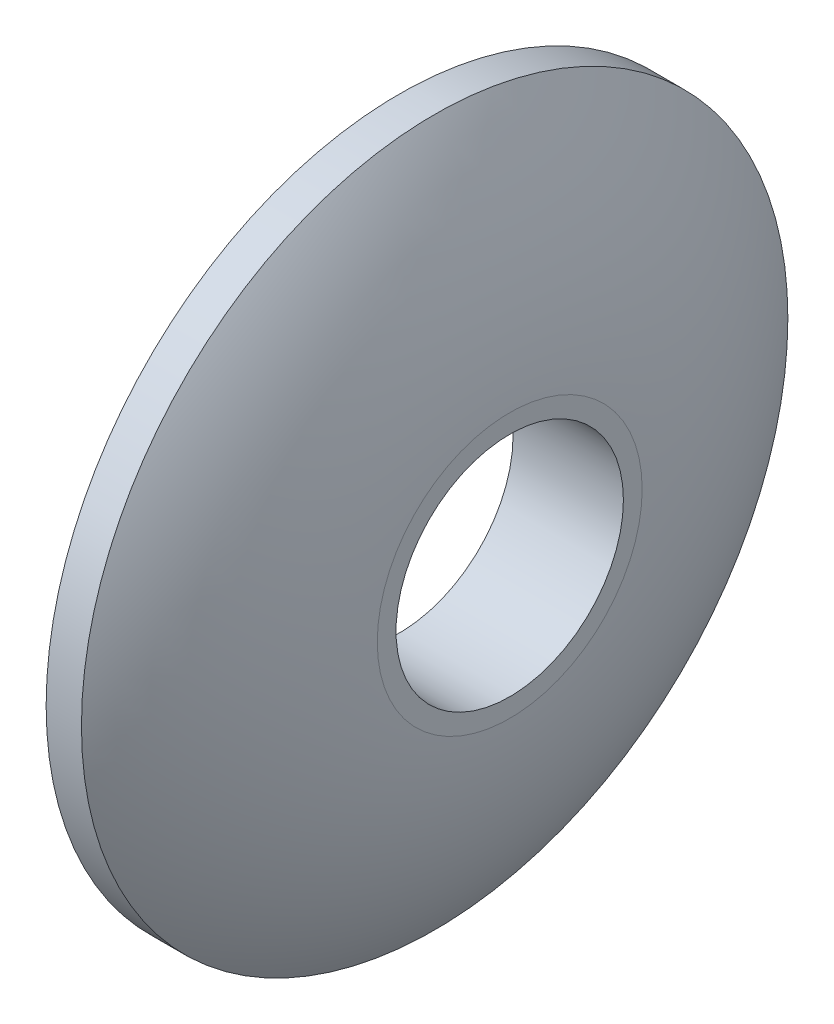
ISO-10303-21;
HEADER;
FILE_DESCRIPTION(('STEP AP214'),'2;1');
FILE_NAME('part.step','',(''),(''),'','','');
FILE_SCHEMA(('AUTOMOTIVE_DESIGN { 1 0 10303 214 1 1 1 1 }'));
ENDSEC;
DATA;
#1=APPLICATION_CONTEXT('core data for automotive mechanical design processes');
#2=APPLICATION_PROTOCOL_DEFINITION('international standard','automotive_design',2000,#1);
#3=PRODUCT_CONTEXT('',#1,'mechanical');
#4=PRODUCT('Part','Part','',(#3));
#5=PRODUCT_RELATED_PRODUCT_CATEGORY('part','',(#4));
#6=PRODUCT_DEFINITION_FORMATION('','',#4);
#7=PRODUCT_DEFINITION_CONTEXT('part definition',#1,'design');
#8=PRODUCT_DEFINITION('design','',#6,#7);
#9=PRODUCT_DEFINITION_SHAPE('','',#8);
#10=(LENGTH_UNIT() NAMED_UNIT(*) SI_UNIT(.MILLI.,.METRE.));
#11=(NAMED_UNIT(*) PLANE_ANGLE_UNIT() SI_UNIT($,.RADIAN.));
#12=(NAMED_UNIT(*) SI_UNIT($,.STERADIAN.) SOLID_ANGLE_UNIT());
#13=UNCERTAINTY_MEASURE_WITH_UNIT(LENGTH_MEASURE(1.E-05),#10,'distance_accuracy_value','');
#14=(GEOMETRIC_REPRESENTATION_CONTEXT(3) GLOBAL_UNCERTAINTY_ASSIGNED_CONTEXT((#13)) GLOBAL_UNIT_ASSIGNED_CONTEXT((#10,
#11,#12)) REPRESENTATION_CONTEXT('',''));
#15=CARTESIAN_POINT('',(0.,0.,0.));
#16=DIRECTION('',(0.,0.,1.));
#17=DIRECTION('',(1.,0.,0.));
#18=AXIS2_PLACEMENT_3D('',#15,#16,#17);
#19=CARTESIAN_POINT('',(0.,0.,0.));
#20=DIRECTION('',(1.,0.,0.));
#21=DIRECTION('',(0.,0.,-1.));
#22=AXIS2_PLACEMENT_3D('',#19,#20,#21);
#23=PLANE('',#22);
#24=CARTESIAN_POINT('',(0.,0.,0.));
#25=DIRECTION('',(1.,0.,0.));
#26=DIRECTION('',(0.,0.,-1.));
#27=AXIS2_PLACEMENT_3D('',#24,#25,#26);
#28=CIRCLE('',#27,2.575);
#29=CARTESIAN_POINT('',(0.,0.,-2.575));
#30=VERTEX_POINT('',#29);
#31=EDGE_CURVE('E54',#30,#30,#28,.T.);
#32=ORIENTED_EDGE('',*,*,#31,.T.);
#33=EDGE_LOOP('',(#32));
#34=FACE_BOUND('',#33,.T.);
#35=CARTESIAN_POINT('',(0.,0.,0.));
#36=DIRECTION('',(-1.,0.,0.));
#37=DIRECTION('',(0.,0.,1.));
#38=AXIS2_PLACEMENT_3D('',#35,#36,#37);
#39=CIRCLE('',#38,8.);
#40=CARTESIAN_POINT('',(0.,0.,8.));
#41=VERTEX_POINT('',#40);
#42=EDGE_CURVE('E10',#41,#41,#39,.T.);
#43=ORIENTED_EDGE('',*,*,#42,.T.);
#44=EDGE_LOOP('',(#43));
#45=FACE_BOUND('',#44,.T.);
#46=ADVANCED_FACE('F37',(#34,#45),#23,.F.);
#47=CARTESIAN_POINT('',(-13.2765957446808,0.,0.));
#48=DIRECTION('',(-1.,0.,0.));
#49=DIRECTION('',(0.,0.,1.));
#50=AXIS2_PLACEMENT_3D('',#47,#48,#49);
#51=CYLINDRICAL_SURFACE('',#50,8.);
#52=ORIENTED_EDGE('',*,*,#42,.F.);
#53=EDGE_LOOP('',(#52));
#54=FACE_BOUND('',#53,.T.);
#55=CARTESIAN_POINT('',(0.799999999999999,0.,0.));
#56=DIRECTION('',(-1.,0.,0.));
#57=DIRECTION('',(0.,0.,1.));
#58=AXIS2_PLACEMENT_3D('',#55,#56,#57);
#59=CIRCLE('',#58,8.);
#60=CARTESIAN_POINT('',(0.799999999999999,0.,8.));
#61=VERTEX_POINT('',#60);
#62=EDGE_CURVE('E44',#61,#61,#59,.T.);
#63=ORIENTED_EDGE('',*,*,#62,.T.);
#64=EDGE_LOOP('',(#63));
#65=FACE_BOUND('',#64,.T.);
#66=ADVANCED_FACE('F80',(#54,#65),#51,.T.);
#67=CARTESIAN_POINT('',(-7.48169551799365,0.,0.));
#68=DIRECTION('',(-1.,0.,0.));
#69=DIRECTION('',(0.,0.,1.));
#70=AXIS2_PLACEMENT_3D('',#67,#68,#69);
#71=DEGENERATE_TOROIDAL_SURFACE('',#70,2.39522352388216,10.,.T.);
#72=ORIENTED_EDGE('',*,*,#62,.F.);
#73=EDGE_LOOP('',(#72));
#74=FACE_BOUND('',#73,.T.);
#75=CARTESIAN_POINT('',(2.5,0.,0.));
#76=DIRECTION('',(-1.,0.,0.));
#77=DIRECTION('',(0.,0.,1.));
#78=AXIS2_PLACEMENT_3D('',#75,#76,#77);
#79=CIRCLE('',#78,3.);
#80=CARTESIAN_POINT('',(2.5,0.,3.));
#81=VERTEX_POINT('',#80);
#82=EDGE_CURVE('E49',#81,#81,#79,.T.);
#83=ORIENTED_EDGE('',*,*,#82,.T.);
#84=EDGE_LOOP('',(#83));
#85=FACE_BOUND('',#84,.T.);
#86=ADVANCED_FACE('F75',(#74,#85),#71,.T.);
#87=CARTESIAN_POINT('',(2.5,3.,0.));
#88=DIRECTION('',(-1.,0.,0.));
#89=DIRECTION('',(0.,0.,1.));
#90=AXIS2_PLACEMENT_3D('',#87,#88,#89);
#91=PLANE('',#90);
#92=CARTESIAN_POINT('',(2.5,0.,0.));
#93=DIRECTION('',(1.,0.,0.));
#94=DIRECTION('',(0.,0.,-1.));
#95=AXIS2_PLACEMENT_3D('',#92,#93,#94);
#96=CIRCLE('',#95,2.575);
#97=CARTESIAN_POINT('',(2.5,0.,-2.575));
#98=VERTEX_POINT('',#97);
#99=EDGE_CURVE('E57',#98,#98,#96,.T.);
#100=ORIENTED_EDGE('',*,*,#99,.F.);
#101=EDGE_LOOP('',(#100));
#102=FACE_BOUND('',#101,.T.);
#103=ORIENTED_EDGE('',*,*,#82,.F.);
#104=EDGE_LOOP('',(#103));
#105=FACE_BOUND('',#104,.T.);
#106=ADVANCED_FACE('F69',(#102,#105),#91,.F.);
#107=CARTESIAN_POINT('',(0.,0.,0.));
#108=DIRECTION('',(1.,0.,0.));
#109=DIRECTION('',(0.,0.,-1.));
#110=AXIS2_PLACEMENT_3D('',#107,#108,#109);
#111=CYLINDRICAL_SURFACE('',#110,2.575);
#112=ORIENTED_EDGE('',*,*,#31,.F.);
#113=EDGE_LOOP('',(#112));
#114=FACE_BOUND('',#113,.T.);
#115=ORIENTED_EDGE('',*,*,#99,.T.);
#116=EDGE_LOOP('',(#115));
#117=FACE_BOUND('',#116,.T.);
#118=ADVANCED_FACE('F66',(#114,#117),#111,.F.);
#119=CLOSED_SHELL('',(#46,#66,#86,#106,#118));
#120=MANIFOLD_SOLID_BREP('B2',#119);
#121=ADVANCED_BREP_SHAPE_REPRESENTATION('',(#18,#120),#14);
#122=SHAPE_DEFINITION_REPRESENTATION(#9,#121);
ENDSEC;
END-ISO-10303-21;
